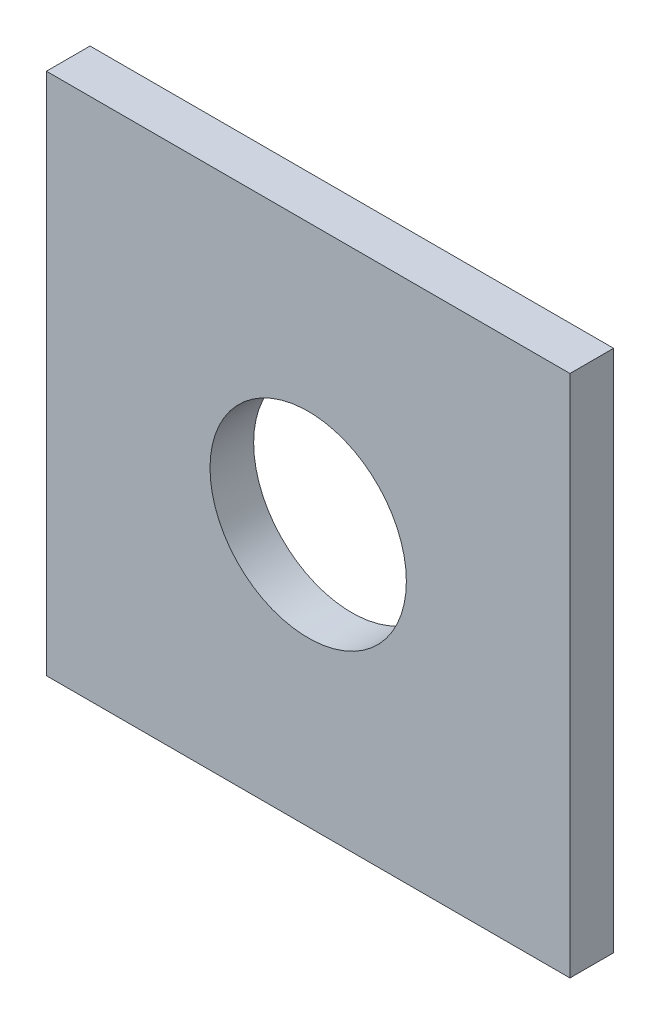
ISO-10303-21;
HEADER;
FILE_DESCRIPTION(('STEP AP214'),'2;1');
FILE_NAME('part.step','',(''),(''),'','','');
FILE_SCHEMA(('AUTOMOTIVE_DESIGN { 1 0 10303 214 1 1 1 1 }'));
ENDSEC;
DATA;
#1=APPLICATION_CONTEXT('core data for automotive mechanical design processes');
#2=APPLICATION_PROTOCOL_DEFINITION('international standard','automotive_design',2000,#1);
#3=PRODUCT_CONTEXT('',#1,'mechanical');
#4=PRODUCT('Part','Part','',(#3));
#5=PRODUCT_RELATED_PRODUCT_CATEGORY('part','',(#4));
#6=PRODUCT_DEFINITION_FORMATION('','',#4);
#7=PRODUCT_DEFINITION_CONTEXT('part definition',#1,'design');
#8=PRODUCT_DEFINITION('design','',#6,#7);
#9=PRODUCT_DEFINITION_SHAPE('','',#8);
#10=(LENGTH_UNIT() NAMED_UNIT(*) SI_UNIT(.MILLI.,.METRE.));
#11=(NAMED_UNIT(*) PLANE_ANGLE_UNIT() SI_UNIT($,.RADIAN.));
#12=(NAMED_UNIT(*) SI_UNIT($,.STERADIAN.) SOLID_ANGLE_UNIT());
#13=UNCERTAINTY_MEASURE_WITH_UNIT(LENGTH_MEASURE(1.E-05),#10,'distance_accuracy_value','');
#14=(GEOMETRIC_REPRESENTATION_CONTEXT(3) GLOBAL_UNCERTAINTY_ASSIGNED_CONTEXT((#13)) GLOBAL_UNIT_ASSIGNED_CONTEXT((#10,
#11,#12)) REPRESENTATION_CONTEXT('',''));
#15=CARTESIAN_POINT('',(0.,0.,0.));
#16=DIRECTION('',(0.,0.,1.));
#17=DIRECTION('',(1.,0.,0.));
#18=AXIS2_PLACEMENT_3D('',#15,#16,#17);
#19=CARTESIAN_POINT('',(0.,0.,6.35));
#20=DIRECTION('',(-1.,0.,0.));
#21=DIRECTION('',(0.,0.,1.));
#22=AXIS2_PLACEMENT_3D('',#19,#20,#21);
#23=PLANE('',#22);
#24=DIRECTION('',(0.,1.,0.));
#25=VECTOR('',#24,1.);
#26=CARTESIAN_POINT('',(0.,0.,0.));
#27=LINE('',#26,#25);
#28=CARTESIAN_POINT('',(0.,0.,0.));
#29=VERTEX_POINT('',#28);
#30=CARTESIAN_POINT('',(0.,76.2,0.));
#31=VERTEX_POINT('',#30);
#32=EDGE_CURVE('E96',#29,#31,#27,.T.);
#33=ORIENTED_EDGE('',*,*,#32,.T.);
#34=DIRECTION('',(0.,0.,-1.));
#35=VECTOR('',#34,1.);
#36=CARTESIAN_POINT('',(0.,76.2,6.35));
#37=LINE('',#36,#35);
#38=CARTESIAN_POINT('',(0.,76.2,6.35));
#39=VERTEX_POINT('',#38);
#40=EDGE_CURVE('E11',#39,#31,#37,.T.);
#41=ORIENTED_EDGE('',*,*,#40,.F.);
#42=DIRECTION('',(0.,1.,0.));
#43=VECTOR('',#42,1.);
#44=CARTESIAN_POINT('',(0.,0.,6.35));
#45=LINE('',#44,#43);
#46=CARTESIAN_POINT('',(0.,0.,6.35));
#47=VERTEX_POINT('',#46);
#48=EDGE_CURVE('E84',#47,#39,#45,.T.);
#49=ORIENTED_EDGE('',*,*,#48,.F.);
#50=DIRECTION('',(0.,0.,-1.));
#51=VECTOR('',#50,1.);
#52=CARTESIAN_POINT('',(0.,0.,6.35));
#53=LINE('',#52,#51);
#54=EDGE_CURVE('E92',#47,#29,#53,.T.);
#55=ORIENTED_EDGE('',*,*,#54,.T.);
#56=EDGE_LOOP('',(#33,#41,#49,#55));
#57=FACE_BOUND('',#56,.T.);
#58=ADVANCED_FACE('F33',(#57),#23,.F.);
#59=CARTESIAN_POINT('',(0.,76.2,6.35));
#60=DIRECTION('',(0.,-1.,0.));
#61=DIRECTION('',(1.,0.,0.));
#62=AXIS2_PLACEMENT_3D('',#59,#60,#61);
#63=PLANE('',#62);
#64=DIRECTION('',(-1.,0.,0.));
#65=VECTOR('',#64,1.);
#66=CARTESIAN_POINT('',(0.,76.2,0.));
#67=LINE('',#66,#65);
#68=CARTESIAN_POINT('',(-76.2,76.2,0.));
#69=VERTEX_POINT('',#68);
#70=EDGE_CURVE('E88',#31,#69,#67,.T.);
#71=ORIENTED_EDGE('',*,*,#70,.T.);
#72=DIRECTION('',(0.,0.,-1.));
#73=VECTOR('',#72,1.);
#74=CARTESIAN_POINT('',(-76.2,76.2,6.35));
#75=LINE('',#74,#73);
#76=CARTESIAN_POINT('',(-76.2,76.2,6.35));
#77=VERTEX_POINT('',#76);
#78=EDGE_CURVE('E41',#77,#69,#75,.T.);
#79=ORIENTED_EDGE('',*,*,#78,.F.);
#80=DIRECTION('',(-1.,0.,0.));
#81=VECTOR('',#80,1.);
#82=CARTESIAN_POINT('',(0.,76.2,6.35));
#83=LINE('',#82,#81);
#84=EDGE_CURVE('E79',#39,#77,#83,.T.);
#85=ORIENTED_EDGE('',*,*,#84,.F.);
#86=ORIENTED_EDGE('',*,*,#40,.T.);
#87=EDGE_LOOP('',(#71,#79,#85,#86));
#88=FACE_BOUND('',#87,.T.);
#89=ADVANCED_FACE('F87',(#88),#63,.F.);
#90=CARTESIAN_POINT('',(-76.2,0.,6.35));
#91=DIRECTION('',(1.,0.,0.));
#92=DIRECTION('',(0.,0.,-1.));
#93=AXIS2_PLACEMENT_3D('',#90,#91,#92);
#94=PLANE('',#93);
#95=DIRECTION('',(0.,-1.,0.));
#96=VECTOR('',#95,1.);
#97=CARTESIAN_POINT('',(-76.2,0.,0.));
#98=LINE('',#97,#96);
#99=CARTESIAN_POINT('',(-76.2,0.,0.));
#100=VERTEX_POINT('',#99);
#101=EDGE_CURVE('E66',#69,#100,#98,.T.);
#102=ORIENTED_EDGE('',*,*,#101,.T.);
#103=DIRECTION('',(0.,0.,-1.));
#104=VECTOR('',#103,1.);
#105=CARTESIAN_POINT('',(-76.2,0.,6.35));
#106=LINE('',#105,#104);
#107=CARTESIAN_POINT('',(-76.2,0.,6.35));
#108=VERTEX_POINT('',#107);
#109=EDGE_CURVE('E89',#108,#100,#106,.T.);
#110=ORIENTED_EDGE('',*,*,#109,.F.);
#111=DIRECTION('',(0.,-1.,0.));
#112=VECTOR('',#111,1.);
#113=CARTESIAN_POINT('',(-76.2,0.,6.35));
#114=LINE('',#113,#112);
#115=EDGE_CURVE('E82',#77,#108,#114,.T.);
#116=ORIENTED_EDGE('',*,*,#115,.F.);
#117=ORIENTED_EDGE('',*,*,#78,.T.);
#118=EDGE_LOOP('',(#102,#110,#116,#117));
#119=FACE_BOUND('',#118,.T.);
#120=ADVANCED_FACE('F90',(#119),#94,.F.);
#121=CARTESIAN_POINT('',(0.,0.,6.35));
#122=DIRECTION('',(0.,1.,0.));
#123=DIRECTION('',(-1.,0.,0.));
#124=AXIS2_PLACEMENT_3D('',#121,#122,#123);
#125=PLANE('',#124);
#126=DIRECTION('',(1.,0.,0.));
#127=VECTOR('',#126,1.);
#128=CARTESIAN_POINT('',(0.,0.,0.));
#129=LINE('',#128,#127);
#130=EDGE_CURVE('E72',#100,#29,#129,.T.);
#131=ORIENTED_EDGE('',*,*,#130,.T.);
#132=ORIENTED_EDGE('',*,*,#54,.F.);
#133=DIRECTION('',(1.,0.,0.));
#134=VECTOR('',#133,1.);
#135=CARTESIAN_POINT('',(0.,0.,6.35));
#136=LINE('',#135,#134);
#137=EDGE_CURVE('E49',#108,#47,#136,.T.);
#138=ORIENTED_EDGE('',*,*,#137,.F.);
#139=ORIENTED_EDGE('',*,*,#109,.T.);
#140=EDGE_LOOP('',(#131,#132,#138,#139));
#141=FACE_BOUND('',#140,.T.);
#142=ADVANCED_FACE('F104',(#141),#125,.F.);
#143=CARTESIAN_POINT('',(0.,0.,6.35));
#144=DIRECTION('',(0.,0.,1.));
#145=DIRECTION('',(1.,0.,0.));
#146=AXIS2_PLACEMENT_3D('',#143,#144,#145);
#147=PLANE('',#146);
#148=CARTESIAN_POINT('',(-38.1,38.1,6.35));
#149=DIRECTION('',(0.,0.,1.));
#150=DIRECTION('',(1.,0.,0.));
#151=AXIS2_PLACEMENT_3D('',#148,#149,#150);
#152=CIRCLE('',#151,14.2875);
#153=CARTESIAN_POINT('',(-23.8125,38.1,6.35));
#154=VERTEX_POINT('',#153);
#155=EDGE_CURVE('E110',#154,#154,#152,.T.);
#156=ORIENTED_EDGE('',*,*,#155,.F.);
#157=EDGE_LOOP('',(#156));
#158=FACE_BOUND('',#157,.T.);
#159=ORIENTED_EDGE('',*,*,#48,.T.);
#160=ORIENTED_EDGE('',*,*,#84,.T.);
#161=ORIENTED_EDGE('',*,*,#115,.T.);
#162=ORIENTED_EDGE('',*,*,#137,.T.);
#163=EDGE_LOOP('',(#159,#160,#161,#162));
#164=FACE_BOUND('',#163,.T.);
#165=ADVANCED_FACE('F80',(#158,#164),#147,.T.);
#166=CARTESIAN_POINT('',(0.,0.,0.));
#167=DIRECTION('',(0.,0.,1.));
#168=DIRECTION('',(1.,0.,0.));
#169=AXIS2_PLACEMENT_3D('',#166,#167,#168);
#170=PLANE('',#169);
#171=CARTESIAN_POINT('',(-38.1,38.1,0.));
#172=DIRECTION('',(0.,0.,1.));
#173=DIRECTION('',(1.,0.,0.));
#174=AXIS2_PLACEMENT_3D('',#171,#172,#173);
#175=CIRCLE('',#174,14.2875);
#176=CARTESIAN_POINT('',(-23.8125,38.1,0.));
#177=VERTEX_POINT('',#176);
#178=EDGE_CURVE('E99',#177,#177,#175,.T.);
#179=ORIENTED_EDGE('',*,*,#178,.T.);
#180=EDGE_LOOP('',(#179));
#181=FACE_BOUND('',#180,.T.);
#182=ORIENTED_EDGE('',*,*,#32,.F.);
#183=ORIENTED_EDGE('',*,*,#130,.F.);
#184=ORIENTED_EDGE('',*,*,#101,.F.);
#185=ORIENTED_EDGE('',*,*,#70,.F.);
#186=EDGE_LOOP('',(#182,#183,#184,#185));
#187=FACE_BOUND('',#186,.T.);
#188=ADVANCED_FACE('F107',(#181,#187),#170,.F.);
#189=CARTESIAN_POINT('',(-38.1,38.1,0.));
#190=DIRECTION('',(0.,0.,1.));
#191=DIRECTION('',(1.,0.,0.));
#192=AXIS2_PLACEMENT_3D('',#189,#190,#191);
#193=CYLINDRICAL_SURFACE('',#192,14.2875);
#194=ORIENTED_EDGE('',*,*,#178,.F.);
#195=EDGE_LOOP('',(#194));
#196=FACE_BOUND('',#195,.T.);
#197=ORIENTED_EDGE('',*,*,#155,.T.);
#198=EDGE_LOOP('',(#197));
#199=FACE_BOUND('',#198,.T.);
#200=ADVANCED_FACE('F117',(#196,#199),#193,.F.);
#201=CLOSED_SHELL('',(#58,#89,#120,#142,#165,#188,#200));
#202=MANIFOLD_SOLID_BREP('B2',#201);
#203=ADVANCED_BREP_SHAPE_REPRESENTATION('',(#18,#202),#14);
#204=SHAPE_DEFINITION_REPRESENTATION(#9,#203);
ENDSEC;
END-ISO-10303-21;
